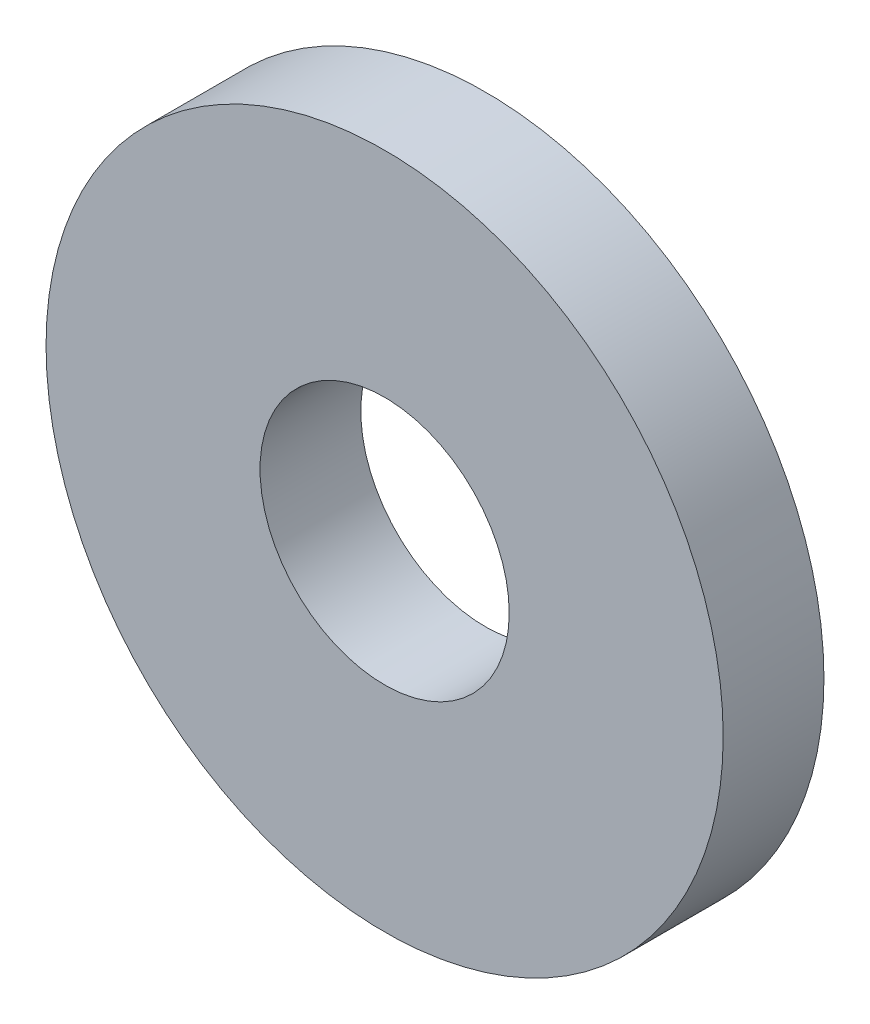
ISO-10303-21;
HEADER;
FILE_DESCRIPTION(('STEP AP214'),'2;1');
FILE_NAME('part.step','',(''),(''),'','','');
FILE_SCHEMA(('AUTOMOTIVE_DESIGN { 1 0 10303 214 1 1 1 1 }'));
ENDSEC;
DATA;
#1=APPLICATION_CONTEXT('core data for automotive mechanical design processes');
#2=APPLICATION_PROTOCOL_DEFINITION('international standard','automotive_design',2000,#1);
#3=PRODUCT_CONTEXT('',#1,'mechanical');
#4=PRODUCT('Part','Part','',(#3));
#5=PRODUCT_RELATED_PRODUCT_CATEGORY('part','',(#4));
#6=PRODUCT_DEFINITION_FORMATION('','',#4);
#7=PRODUCT_DEFINITION_CONTEXT('part definition',#1,'design');
#8=PRODUCT_DEFINITION('design','',#6,#7);
#9=PRODUCT_DEFINITION_SHAPE('','',#8);
#10=(LENGTH_UNIT() NAMED_UNIT(*) SI_UNIT(.MILLI.,.METRE.));
#11=(NAMED_UNIT(*) PLANE_ANGLE_UNIT() SI_UNIT($,.RADIAN.));
#12=(NAMED_UNIT(*) SI_UNIT($,.STERADIAN.) SOLID_ANGLE_UNIT());
#13=UNCERTAINTY_MEASURE_WITH_UNIT(LENGTH_MEASURE(1.E-05),#10,'distance_accuracy_value','');
#14=(GEOMETRIC_REPRESENTATION_CONTEXT(3) GLOBAL_UNCERTAINTY_ASSIGNED_CONTEXT((#13)) GLOBAL_UNIT_ASSIGNED_CONTEXT((#10,
#11,#12)) REPRESENTATION_CONTEXT('',''));
#15=CARTESIAN_POINT('',(0.,0.,0.));
#16=DIRECTION('',(0.,0.,1.));
#17=DIRECTION('',(1.,0.,0.));
#18=AXIS2_PLACEMENT_3D('',#15,#16,#17);
#19=CARTESIAN_POINT('',(0.,0.,-2.3622));
#20=DIRECTION('',(0.,0.,1.));
#21=DIRECTION('',(1.,0.,0.));
#22=AXIS2_PLACEMENT_3D('',#19,#20,#21);
#23=CYLINDRICAL_SURFACE('',#22,7.9375);
#24=CARTESIAN_POINT('',(0.,0.,-2.3622));
#25=DIRECTION('',(0.,0.,1.));
#26=DIRECTION('',(1.,0.,0.));
#27=AXIS2_PLACEMENT_3D('',#24,#25,#26);
#28=CIRCLE('',#27,7.9375);
#29=CARTESIAN_POINT('',(7.9375,0.,-2.3622));
#30=VERTEX_POINT('',#29);
#31=EDGE_CURVE('E10',#30,#30,#28,.T.);
#32=ORIENTED_EDGE('',*,*,#31,.T.);
#33=EDGE_LOOP('',(#32));
#34=FACE_BOUND('',#33,.T.);
#35=CARTESIAN_POINT('',(0.,0.,0.));
#36=DIRECTION('',(0.,0.,1.));
#37=DIRECTION('',(1.,0.,0.));
#38=AXIS2_PLACEMENT_3D('',#35,#36,#37);
#39=CIRCLE('',#38,7.9375);
#40=CARTESIAN_POINT('',(7.9375,0.,0.));
#41=VERTEX_POINT('',#40);
#42=EDGE_CURVE('E33',#41,#41,#39,.T.);
#43=ORIENTED_EDGE('',*,*,#42,.F.);
#44=EDGE_LOOP('',(#43));
#45=FACE_BOUND('',#44,.T.);
#46=ADVANCED_FACE('F30',(#34,#45),#23,.T.);
#47=CARTESIAN_POINT('',(0.,0.,-2.3622));
#48=DIRECTION('',(0.,0.,1.));
#49=DIRECTION('',(1.,0.,0.));
#50=AXIS2_PLACEMENT_3D('',#47,#48,#49);
#51=PLANE('',#50);
#52=CARTESIAN_POINT('',(0.,0.,-2.3622));
#53=DIRECTION('',(0.,0.,1.));
#54=DIRECTION('',(1.,0.,0.));
#55=AXIS2_PLACEMENT_3D('',#52,#53,#54);
#56=CIRCLE('',#55,2.921);
#57=CARTESIAN_POINT('',(2.921,0.,-2.3622));
#58=VERTEX_POINT('',#57);
#59=EDGE_CURVE('E40',#58,#58,#56,.T.);
#60=ORIENTED_EDGE('',*,*,#59,.T.);
#61=EDGE_LOOP('',(#60));
#62=FACE_BOUND('',#61,.T.);
#63=ORIENTED_EDGE('',*,*,#31,.F.);
#64=EDGE_LOOP('',(#63));
#65=FACE_BOUND('',#64,.T.);
#66=ADVANCED_FACE('F48',(#62,#65),#51,.F.);
#67=CARTESIAN_POINT('',(0.,0.,0.));
#68=DIRECTION('',(0.,0.,1.));
#69=DIRECTION('',(1.,0.,0.));
#70=AXIS2_PLACEMENT_3D('',#67,#68,#69);
#71=PLANE('',#70);
#72=CARTESIAN_POINT('',(0.,0.,0.));
#73=DIRECTION('',(0.,0.,1.));
#74=DIRECTION('',(1.,0.,0.));
#75=AXIS2_PLACEMENT_3D('',#72,#73,#74);
#76=CIRCLE('',#75,2.921);
#77=CARTESIAN_POINT('',(2.921,0.,0.));
#78=VERTEX_POINT('',#77);
#79=EDGE_CURVE('E42',#78,#78,#76,.T.);
#80=ORIENTED_EDGE('',*,*,#79,.F.);
#81=EDGE_LOOP('',(#80));
#82=FACE_BOUND('',#81,.T.);
#83=ORIENTED_EDGE('',*,*,#42,.T.);
#84=EDGE_LOOP('',(#83));
#85=FACE_BOUND('',#84,.T.);
#86=ADVANCED_FACE('F54',(#82,#85),#71,.T.);
#87=CARTESIAN_POINT('',(0.,0.,-2.3622));
#88=DIRECTION('',(0.,0.,1.));
#89=DIRECTION('',(1.,0.,0.));
#90=AXIS2_PLACEMENT_3D('',#87,#88,#89);
#91=CYLINDRICAL_SURFACE('',#90,2.921);
#92=ORIENTED_EDGE('',*,*,#59,.F.);
#93=EDGE_LOOP('',(#92));
#94=FACE_BOUND('',#93,.T.);
#95=ORIENTED_EDGE('',*,*,#79,.T.);
#96=EDGE_LOOP('',(#95));
#97=FACE_BOUND('',#96,.T.);
#98=ADVANCED_FACE('F51',(#94,#97),#91,.F.);
#99=CLOSED_SHELL('',(#46,#66,#86,#98));
#100=MANIFOLD_SOLID_BREP('B2',#99);
#101=ADVANCED_BREP_SHAPE_REPRESENTATION('',(#18,#100),#14);
#102=SHAPE_DEFINITION_REPRESENTATION(#9,#101);
ENDSEC;
END-ISO-10303-21;
